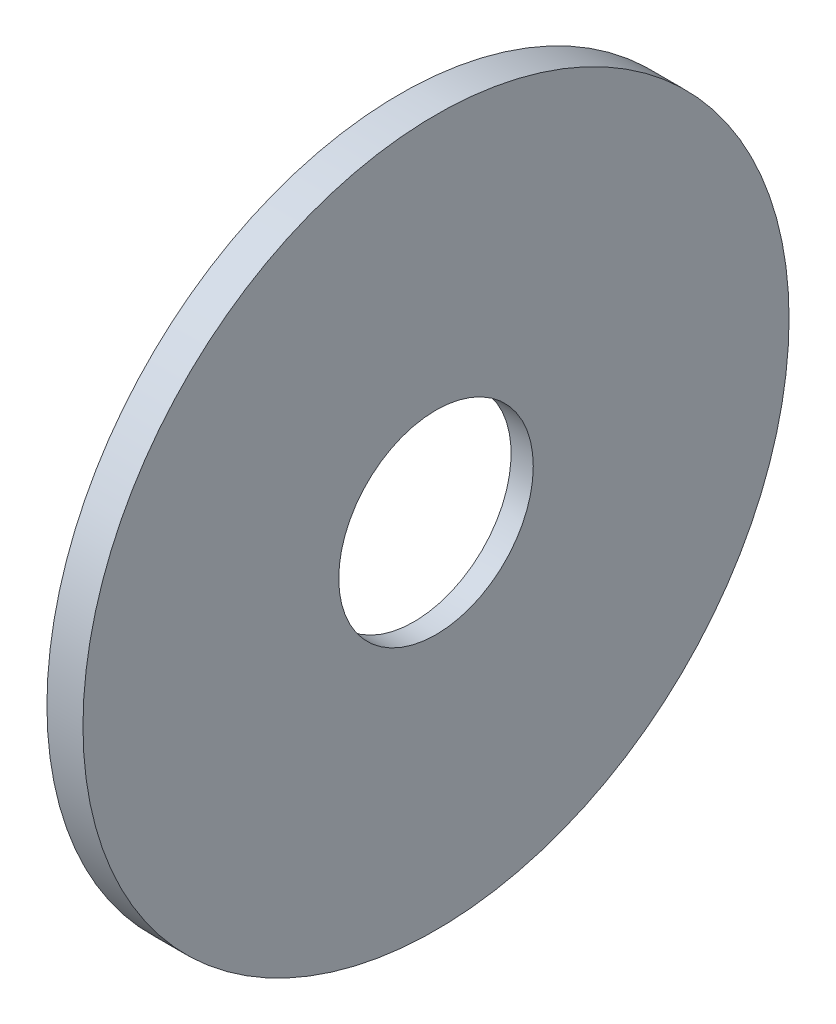
ISO-10303-21;
HEADER;
FILE_DESCRIPTION(('STEP AP214'),'2;1');
FILE_NAME('part.step','',(''),(''),'','','');
FILE_SCHEMA(('AUTOMOTIVE_DESIGN { 1 0 10303 214 1 1 1 1 }'));
ENDSEC;
DATA;
#1=APPLICATION_CONTEXT('core data for automotive mechanical design processes');
#2=APPLICATION_PROTOCOL_DEFINITION('international standard','automotive_design',2000,#1);
#3=PRODUCT_CONTEXT('',#1,'mechanical');
#4=PRODUCT('Part','Part','',(#3));
#5=PRODUCT_RELATED_PRODUCT_CATEGORY('part','',(#4));
#6=PRODUCT_DEFINITION_FORMATION('','',#4);
#7=PRODUCT_DEFINITION_CONTEXT('part definition',#1,'design');
#8=PRODUCT_DEFINITION('design','',#6,#7);
#9=PRODUCT_DEFINITION_SHAPE('','',#8);
#10=(LENGTH_UNIT() NAMED_UNIT(*) SI_UNIT(.MILLI.,.METRE.));
#11=(NAMED_UNIT(*) PLANE_ANGLE_UNIT() SI_UNIT($,.RADIAN.));
#12=(NAMED_UNIT(*) SI_UNIT($,.STERADIAN.) SOLID_ANGLE_UNIT());
#13=UNCERTAINTY_MEASURE_WITH_UNIT(LENGTH_MEASURE(1.E-05),#10,'distance_accuracy_value','');
#14=(GEOMETRIC_REPRESENTATION_CONTEXT(3) GLOBAL_UNCERTAINTY_ASSIGNED_CONTEXT((#13)) GLOBAL_UNIT_ASSIGNED_CONTEXT((#10,
#11,#12)) REPRESENTATION_CONTEXT('',''));
#15=CARTESIAN_POINT('',(0.,0.,0.));
#16=DIRECTION('',(0.,0.,1.));
#17=DIRECTION('',(1.,0.,0.));
#18=AXIS2_PLACEMENT_3D('',#15,#16,#17);
#19=CARTESIAN_POINT('',(5.,0.,0.));
#20=DIRECTION('',(-1.,0.,0.));
#21=DIRECTION('',(0.,0.,1.));
#22=AXIS2_PLACEMENT_3D('',#19,#20,#21);
#23=CYLINDRICAL_SURFACE('',#22,13.5);
#24=CARTESIAN_POINT('',(5.,0.,0.));
#25=DIRECTION('',(1.,0.,0.));
#26=DIRECTION('',(0.,0.,-1.));
#27=AXIS2_PLACEMENT_3D('',#24,#25,#26);
#28=CIRCLE('',#27,13.5);
#29=CARTESIAN_POINT('',(5.,0.,-13.5));
#30=VERTEX_POINT('',#29);
#31=EDGE_CURVE('E42',#30,#30,#28,.T.);
#32=ORIENTED_EDGE('',*,*,#31,.T.);
#33=EDGE_LOOP('',(#32));
#34=FACE_BOUND('',#33,.T.);
#35=CARTESIAN_POINT('',(1.92247370308196,0.,0.));
#36=DIRECTION('',(-1.,0.,0.));
#37=DIRECTION('',(0.,0.,1.));
#38=AXIS2_PLACEMENT_3D('',#35,#36,#37);
#39=CIRCLE('',#38,13.5);
#40=CARTESIAN_POINT('',(1.92247370308196,0.,13.5));
#41=VERTEX_POINT('',#40);
#42=EDGE_CURVE('E38',#41,#41,#39,.T.);
#43=ORIENTED_EDGE('',*,*,#42,.T.);
#44=EDGE_LOOP('',(#43));
#45=FACE_BOUND('',#44,.T.);
#46=ADVANCED_FACE('F34',(#34,#45),#23,.F.);
#47=CARTESIAN_POINT('',(5.,0.,0.));
#48=DIRECTION('',(1.,0.,0.));
#49=DIRECTION('',(0.,0.,-1.));
#50=AXIS2_PLACEMENT_3D('',#47,#48,#49);
#51=PLANE('',#50);
#52=CARTESIAN_POINT('',(5.,0.,0.));
#53=DIRECTION('',(1.,0.,0.));
#54=DIRECTION('',(0.,0.,-1.));
#55=AXIS2_PLACEMENT_3D('',#52,#53,#54);
#56=CIRCLE('',#55,49.);
#57=CARTESIAN_POINT('',(5.,0.,-49.));
#58=VERTEX_POINT('',#57);
#59=EDGE_CURVE('E10',#58,#58,#56,.T.);
#60=ORIENTED_EDGE('',*,*,#59,.T.);
#61=EDGE_LOOP('',(#60));
#62=FACE_BOUND('',#61,.T.);
#63=ORIENTED_EDGE('',*,*,#31,.F.);
#64=EDGE_LOOP('',(#63));
#65=FACE_BOUND('',#64,.T.);
#66=ADVANCED_FACE('F62',(#62,#65),#51,.T.);
#67=CARTESIAN_POINT('',(5.,0.,0.));
#68=DIRECTION('',(-1.,0.,0.));
#69=DIRECTION('',(0.,0.,1.));
#70=AXIS2_PLACEMENT_3D('',#67,#68,#69);
#71=CYLINDRICAL_SURFACE('',#70,49.);
#72=ORIENTED_EDGE('',*,*,#59,.F.);
#73=EDGE_LOOP('',(#72));
#74=FACE_BOUND('',#73,.T.);
#75=CARTESIAN_POINT('',(1.11022302462516E-13,0.,0.));
#76=DIRECTION('',(-1.,0.,0.));
#77=DIRECTION('',(0.,0.,1.));
#78=AXIS2_PLACEMENT_3D('',#75,#76,#77);
#79=CIRCLE('',#78,49.);
#80=CARTESIAN_POINT('',(1.11022302462516E-13,0.,49.));
#81=VERTEX_POINT('',#80);
#82=EDGE_CURVE('E48',#81,#81,#79,.T.);
#83=ORIENTED_EDGE('',*,*,#82,.F.);
#84=EDGE_LOOP('',(#83));
#85=FACE_BOUND('',#84,.T.);
#86=ADVANCED_FACE('F36',(#74,#85),#71,.T.);
#87=CARTESIAN_POINT('',(-505.235485174739,0.,0.));
#88=DIRECTION('',(-1.,0.,0.));
#89=DIRECTION('',(0.,0.,1.));
#90=AXIS2_PLACEMENT_3D('',#87,#88,#89);
#91=DEGENERATE_TOROIDAL_SURFACE('',#90,3.83732713572492,507.25,.T.);
#92=ORIENTED_EDGE('',*,*,#42,.F.);
#93=EDGE_LOOP('',(#92));
#94=FACE_BOUND('',#93,.T.);
#95=ORIENTED_EDGE('',*,*,#82,.T.);
#96=EDGE_LOOP('',(#95));
#97=FACE_BOUND('',#96,.T.);
#98=ADVANCED_FACE('F56',(#94,#97),#91,.F.);
#99=CLOSED_SHELL('',(#46,#66,#86,#98));
#100=MANIFOLD_SOLID_BREP('B2',#99);
#101=ADVANCED_BREP_SHAPE_REPRESENTATION('',(#18,#100),#14);
#102=SHAPE_DEFINITION_REPRESENTATION(#9,#101);
ENDSEC;
END-ISO-10303-21;
